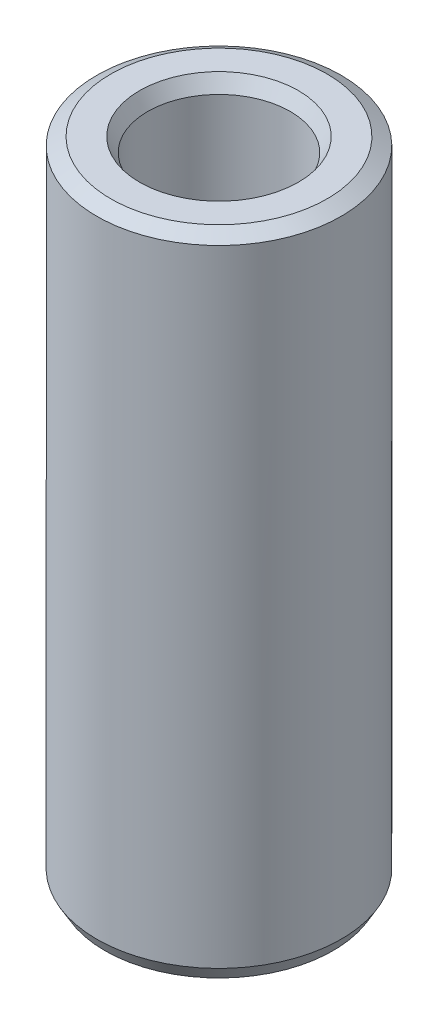
ISO-10303-21;
HEADER;
FILE_DESCRIPTION(('STEP AP214'),'2;1');
FILE_NAME('part.step','',(''),(''),'','','');
FILE_SCHEMA(('AUTOMOTIVE_DESIGN { 1 0 10303 214 1 1 1 1 }'));
ENDSEC;
DATA;
#1=APPLICATION_CONTEXT('core data for automotive mechanical design processes');
#2=APPLICATION_PROTOCOL_DEFINITION('international standard','automotive_design',2000,#1);
#3=PRODUCT_CONTEXT('',#1,'mechanical');
#4=PRODUCT('Part','Part','',(#3));
#5=PRODUCT_RELATED_PRODUCT_CATEGORY('part','',(#4));
#6=PRODUCT_DEFINITION_FORMATION('','',#4);
#7=PRODUCT_DEFINITION_CONTEXT('part definition',#1,'design');
#8=PRODUCT_DEFINITION('design','',#6,#7);
#9=PRODUCT_DEFINITION_SHAPE('','',#8);
#10=(LENGTH_UNIT() NAMED_UNIT(*) SI_UNIT(.MILLI.,.METRE.));
#11=(NAMED_UNIT(*) PLANE_ANGLE_UNIT() SI_UNIT($,.RADIAN.));
#12=(NAMED_UNIT(*) SI_UNIT($,.STERADIAN.) SOLID_ANGLE_UNIT());
#13=UNCERTAINTY_MEASURE_WITH_UNIT(LENGTH_MEASURE(1.E-05),#10,'distance_accuracy_value','');
#14=(GEOMETRIC_REPRESENTATION_CONTEXT(3) GLOBAL_UNCERTAINTY_ASSIGNED_CONTEXT((#13)) GLOBAL_UNIT_ASSIGNED_CONTEXT((#10,
#11,#12)) REPRESENTATION_CONTEXT('',''));
#15=CARTESIAN_POINT('',(0.,0.,0.));
#16=DIRECTION('',(0.,0.,1.));
#17=DIRECTION('',(1.,0.,0.));
#18=AXIS2_PLACEMENT_3D('',#15,#16,#17);
#19=CARTESIAN_POINT('',(0.,225.431002696358,0.));
#20=DIRECTION('',(0.,-1.,0.));
#21=DIRECTION('',(0.,0.,-1.));
#22=AXIS2_PLACEMENT_3D('',#19,#20,#21);
#23=CYLINDRICAL_SURFACE('',#22,42.5);
#24=CARTESIAN_POINT('',(0.,4.87765671901039,0.));
#25=DIRECTION('',(0.,1.,0.));
#26=DIRECTION('',(0.,0.,1.));
#27=AXIS2_PLACEMENT_3D('',#24,#25,#26);
#28=CIRCLE('',#27,42.5);
#29=CARTESIAN_POINT('',(0.,4.87765671901036,-42.5));
#30=VERTEX_POINT('',#29);
#31=EDGE_CURVE('E10',#30,#30,#28,.T.);
#32=CARTESIAN_POINT('',(0.,222.614886276623,0.));
#33=DIRECTION('',(0.,1.,0.));
#34=DIRECTION('',(0.,0.,1.));
#35=AXIS2_PLACEMENT_3D('',#32,#33,#34);
#36=CIRCLE('',#35,42.5);
#37=CARTESIAN_POINT('',(0.,222.614886276623,-42.5));
#38=VERTEX_POINT('',#37);
#39=EDGE_CURVE('E50',#38,#38,#36,.F.);
#40=CARTESIAN_POINT('',(0.,4.87765671901036,-42.5));
#41=CARTESIAN_POINT('',(0.,7.14575286023549,-42.5));
#42=CARTESIAN_POINT('',(0.,9.41384900146062,-42.5));
#43=CARTESIAN_POINT('',(0.,13.9500412839109,-42.5));
#44=CARTESIAN_POINT('',(0.,16.218137425136,-42.5));
#45=CARTESIAN_POINT('',(0.,20.7543297075863,-42.5));
#46=CARTESIAN_POINT('',(0.,23.0224258488114,-42.5));
#47=CARTESIAN_POINT('',(0.,27.5586181312617,-42.5));
#48=CARTESIAN_POINT('',(0.,29.8267142724868,-42.5));
#49=CARTESIAN_POINT('',(0.,34.362906554937,-42.5));
#50=CARTESIAN_POINT('',(0.,36.6310026961622,-42.5));
#51=CARTESIAN_POINT('',(0.,41.1671949786124,-42.5));
#52=CARTESIAN_POINT('',(0.,43.4352911198376,-42.5));
#53=CARTESIAN_POINT('',(0.,47.9714834022878,-42.5));
#54=CARTESIAN_POINT('',(0.,50.2395795435129,-42.5));
#55=CARTESIAN_POINT('',(0.,54.7757718259632,-42.5));
#56=CARTESIAN_POINT('',(0.,57.0438679671883,-42.5));
#57=CARTESIAN_POINT('',(0.,61.5800602496386,-42.5));
#58=CARTESIAN_POINT('',(0.,63.8481563908637,-42.5));
#59=CARTESIAN_POINT('',(0.,68.384348673314,-42.5));
#60=CARTESIAN_POINT('',(0.,70.6524448145391,-42.5));
#61=CARTESIAN_POINT('',(0.,75.1886370969894,-42.5));
#62=CARTESIAN_POINT('',(0.,77.4567332382145,-42.5));
#63=CARTESIAN_POINT('',(0.,81.9929255206648,-42.5));
#64=CARTESIAN_POINT('',(0.,84.2610216618899,-42.5));
#65=CARTESIAN_POINT('',(0.,88.7972139443401,-42.5));
#66=CARTESIAN_POINT('',(0.,91.0653100855653,-42.5));
#67=CARTESIAN_POINT('',(0.,95.6015023680156,-42.5));
#68=CARTESIAN_POINT('',(0.,97.8695985092407,-42.5));
#69=CARTESIAN_POINT('',(0.,102.405790791691,-42.5));
#70=CARTESIAN_POINT('',(0.,104.673886932916,-42.5));
#71=CARTESIAN_POINT('',(0.,109.210079215366,-42.5));
#72=CARTESIAN_POINT('',(0.,111.478175356591,-42.5));
#73=CARTESIAN_POINT('',(0.,116.014367639042,-42.5));
#74=CARTESIAN_POINT('',(0.,118.282463780267,-42.5));
#75=CARTESIAN_POINT('',(0.,122.818656062717,-42.5));
#76=CARTESIAN_POINT('',(0.,125.086752203942,-42.5));
#77=CARTESIAN_POINT('',(0.,129.622944486392,-42.5));
#78=CARTESIAN_POINT('',(0.,131.891040627618,-42.5));
#79=CARTESIAN_POINT('',(0.,136.427232910068,-42.5));
#80=CARTESIAN_POINT('',(0.,138.695329051293,-42.5));
#81=CARTESIAN_POINT('',(0.,143.231521333743,-42.5));
#82=CARTESIAN_POINT('',(0.,145.499617474968,-42.5));
#83=CARTESIAN_POINT('',(0.,150.035809757419,-42.5));
#84=CARTESIAN_POINT('',(0.,152.303905898644,-42.5));
#85=CARTESIAN_POINT('',(0.,156.840098181094,-42.5));
#86=CARTESIAN_POINT('',(0.,159.108194322319,-42.5));
#87=CARTESIAN_POINT('',(0.,163.644386604769,-42.5));
#88=CARTESIAN_POINT('',(0.,165.912482745995,-42.5));
#89=CARTESIAN_POINT('',(0.,170.448675028445,-42.5));
#90=CARTESIAN_POINT('',(0.,172.71677116967,-42.5));
#91=CARTESIAN_POINT('',(0.,177.25296345212,-42.5));
#92=CARTESIAN_POINT('',(0.,179.521059593345,-42.5));
#93=CARTESIAN_POINT('',(0.,184.057251875796,-42.5));
#94=CARTESIAN_POINT('',(0.,186.325348017021,-42.5));
#95=CARTESIAN_POINT('',(0.,190.861540299471,-42.5));
#96=CARTESIAN_POINT('',(0.,193.129636440696,-42.5));
#97=CARTESIAN_POINT('',(0.,197.665828723146,-42.5));
#98=CARTESIAN_POINT('',(0.,199.933924864371,-42.5));
#99=CARTESIAN_POINT('',(0.,204.470117146822,-42.5));
#100=CARTESIAN_POINT('',(0.,206.738213288047,-42.5));
#101=CARTESIAN_POINT('',(0.,211.274405570497,-42.5));
#102=CARTESIAN_POINT('',(0.,213.542501711722,-42.5));
#103=CARTESIAN_POINT('',(0.,218.078693994173,-42.5));
#104=CARTESIAN_POINT('',(0.,220.346790135398,-42.5));
#105=CARTESIAN_POINT('',(0.,222.614886276623,-42.5));
#106=B_SPLINE_CURVE_WITH_KNOTS('',3,(#40,#41,#42,#43,#44,#45,#46,#47,#48,#49,#50,#51,#52,#53,
#54,#55,#56,#57,#58,#59,#60,#61,#62,#63,#64,#65,#66,#67,#68,#69,#70,#71,#72,#73,#74,#75,#76,#77,
#78,#79,#80,#81,#82,#83,#84,#85,#86,#87,#88,#89,#90,#91,#92,#93,#94,#95,#96,#97,#98,#99,#100,
#101,#102,#103,#104,#105),.UNSPECIFIED.,.F.,.F.,(4,2,2,2,2,2,2,2,2,2,2,2,2,2,2,2,2,2,2,2,2,2,2,
2,2,2,2,2,2,2,2,2,4),(0.,6.80428842367539,13.6085768473508,20.4128652710262,27.2171536947016,
34.0214421183769,40.8257305420523,47.6300189657277,54.4343073894031,61.2385958130785,
68.0428842367539,74.8471726604293,81.6514610841047,88.4557495077801,95.2600379314554,
102.064326355131,108.868614778806,115.672903202482,122.477191626157,129.281480049832,
136.085768473508,142.890056897183,149.694345320859,156.498633744534,163.302922168209,
170.107210591885,176.91149901556,183.715787439235,190.520075862911,197.324364286586,
204.128652710262,210.932941133937,217.737229557612),.UNSPECIFIED.);
#107=EDGE_CURVE('BSEAM39',#30,#38,#106,.T.);
#108=ORIENTED_EDGE('',*,*,#31,.T.);
#109=ORIENTED_EDGE('',*,*,#39,.T.);
#110=ORIENTED_EDGE('',*,*,#107,.T.);
#111=ORIENTED_EDGE('',*,*,#107,.F.);
#112=EDGE_LOOP('',(#108,#110,#109,#111));
#113=FACE_BOUND('',#112,.T.);
#114=ADVANCED_FACE('F39',(#113),#23,.T.);
#115=CARTESIAN_POINT('',(0.,225.431002696358,0.));
#116=DIRECTION('',(0.,1.,0.));
#117=DIRECTION('',(0.,0.,1.));
#118=AXIS2_PLACEMENT_3D('',#115,#116,#117);
#119=PLANE('',#118);
#120=CARTESIAN_POINT('',(0.,225.431002696358,0.));
#121=DIRECTION('',(0.,1.,0.));
#122=DIRECTION('',(0.,0.,1.));
#123=AXIS2_PLACEMENT_3D('',#120,#121,#122);
#124=CIRCLE('',#123,27.6163569974663);
#125=CARTESIAN_POINT('',(0.,225.431002696358,27.6163569974663));
#126=VERTEX_POINT('',#125);
#127=EDGE_CURVE('E58',#126,#126,#124,.F.);
#128=ORIENTED_EDGE('',*,*,#127,.T.);
#129=EDGE_LOOP('',(#128));
#130=FACE_BOUND('',#129,.T.);
#131=CARTESIAN_POINT('',(0.,225.431002696358,0.));
#132=DIRECTION('',(0.,1.,0.));
#133=DIRECTION('',(0.,0.,1.));
#134=AXIS2_PLACEMENT_3D('',#131,#132,#133);
#135=CIRCLE('',#134,37.6223432809901);
#136=CARTESIAN_POINT('',(0.,225.431002696358,-37.6223432809901));
#137=VERTEX_POINT('',#136);
#138=EDGE_CURVE('E61',#137,#137,#135,.T.);
#139=ORIENTED_EDGE('',*,*,#138,.T.);
#140=EDGE_LOOP('',(#139));
#141=FACE_BOUND('',#140,.T.);
#142=ADVANCED_FACE('F88',(#130,#141),#119,.T.);
#143=CARTESIAN_POINT('',(0.,0.,0.));
#144=DIRECTION('',(0.,1.,0.));
#145=DIRECTION('',(0.,0.,1.));
#146=AXIS2_PLACEMENT_3D('',#143,#144,#145);
#147=PLANE('',#146);
#148=CARTESIAN_POINT('',(0.,0.,0.));
#149=DIRECTION('',(0.,1.,0.));
#150=DIRECTION('',(0.,0.,1.));
#151=AXIS2_PLACEMENT_3D('',#148,#149,#150);
#152=CIRCLE('',#151,29.6778972967411);
#153=CARTESIAN_POINT('',(0.,0.,29.6778972967411));
#154=VERTEX_POINT('',#153);
#155=EDGE_CURVE('E51',#154,#154,#152,.T.);
#156=ORIENTED_EDGE('',*,*,#155,.T.);
#157=EDGE_LOOP('',(#156));
#158=FACE_BOUND('',#157,.T.);
#159=CARTESIAN_POINT('',(0.,0.,0.));
#160=DIRECTION('',(0.,1.,0.));
#161=DIRECTION('',(0.,0.,1.));
#162=AXIS2_PLACEMENT_3D('',#159,#160,#161);
#163=CIRCLE('',#162,39.6838835802648);
#164=CARTESIAN_POINT('',(0.,0.,39.6838835802648));
#165=VERTEX_POINT('',#164);
#166=EDGE_CURVE('E54',#165,#165,#163,.F.);
#167=ORIENTED_EDGE('',*,*,#166,.T.);
#168=EDGE_LOOP('',(#167));
#169=FACE_BOUND('',#168,.T.);
#170=ADVANCED_FACE('F83',(#158,#169),#147,.F.);
#171=CARTESIAN_POINT('',(0.,225.431002696358,0.));
#172=DIRECTION('',(0.,-1.,0.));
#173=DIRECTION('',(0.,0.,-1.));
#174=AXIS2_PLACEMENT_3D('',#171,#172,#173);
#175=CYLINDRICAL_SURFACE('',#174,24.8002405777311);
#176=CARTESIAN_POINT('',(0.,220.553345977348,0.));
#177=DIRECTION('',(0.,1.,0.));
#178=DIRECTION('',(0.,0.,1.));
#179=AXIS2_PLACEMENT_3D('',#176,#177,#178);
#180=CIRCLE('',#179,24.8002405777311);
#181=CARTESIAN_POINT('',(0.,220.553345977347,-24.8002405777311));
#182=VERTEX_POINT('',#181);
#183=EDGE_CURVE('E67',#182,#182,#180,.T.);
#184=CARTESIAN_POINT('',(0.,2.81611641973503,0.));
#185=DIRECTION('',(0.,1.,0.));
#186=DIRECTION('',(0.,0.,1.));
#187=AXIS2_PLACEMENT_3D('',#184,#185,#186);
#188=CIRCLE('',#187,24.8002405777311);
#189=CARTESIAN_POINT('',(0.,2.816116419735,-24.8002405777311));
#190=VERTEX_POINT('',#189);
#191=EDGE_CURVE('E69',#190,#190,#188,.F.);
#192=CARTESIAN_POINT('',(0.,220.553345977347,-24.8002405777311));
#193=CARTESIAN_POINT('',(0.,218.285249836122,-24.8002405777311));
#194=CARTESIAN_POINT('',(0.,216.017153694897,-24.8002405777311));
#195=CARTESIAN_POINT('',(0.,211.480961412447,-24.8002405777311));
#196=CARTESIAN_POINT('',(0.,209.212865271222,-24.8002405777311));
#197=CARTESIAN_POINT('',(0.,204.676672988772,-24.8002405777311));
#198=CARTESIAN_POINT('',(0.,202.408576847546,-24.8002405777311));
#199=CARTESIAN_POINT('',(0.,197.872384565096,-24.8002405777311));
#200=CARTESIAN_POINT('',(0.,195.604288423871,-24.8002405777311));
#201=CARTESIAN_POINT('',(0.,191.068096141421,-24.8002405777311));
#202=CARTESIAN_POINT('',(0.,188.800000000196,-24.8002405777311));
#203=CARTESIAN_POINT('',(0.,184.263807717745,-24.8002405777311));
#204=CARTESIAN_POINT('',(0.,181.99571157652,-24.8002405777311));
#205=CARTESIAN_POINT('',(0.,177.45951929407,-24.8002405777311));
#206=CARTESIAN_POINT('',(0.,175.191423152845,-24.8002405777311));
#207=CARTESIAN_POINT('',(0.,170.655230870395,-24.8002405777311));
#208=CARTESIAN_POINT('',(0.,168.38713472917,-24.8002405777311));
#209=CARTESIAN_POINT('',(0.,163.850942446719,-24.8002405777311));
#210=CARTESIAN_POINT('',(0.,161.582846305494,-24.8002405777311));
#211=CARTESIAN_POINT('',(0.,157.046654023044,-24.8002405777311));
#212=CARTESIAN_POINT('',(0.,154.778557881819,-24.8002405777311));
#213=CARTESIAN_POINT('',(0.,150.242365599368,-24.8002405777311));
#214=CARTESIAN_POINT('',(0.,147.974269458143,-24.8002405777311));
#215=CARTESIAN_POINT('',(0.,143.438077175693,-24.8002405777311));
#216=CARTESIAN_POINT('',(0.,141.169981034468,-24.8002405777311));
#217=CARTESIAN_POINT('',(0.,136.633788752018,-24.8002405777311));
#218=CARTESIAN_POINT('',(0.,134.365692610793,-24.8002405777311));
#219=CARTESIAN_POINT('',(0.,129.829500328342,-24.8002405777311));
#220=CARTESIAN_POINT('',(0.,127.561404187117,-24.8002405777311));
#221=CARTESIAN_POINT('',(0.,123.025211904667,-24.8002405777311));
#222=CARTESIAN_POINT('',(0.,120.757115763442,-24.8002405777311));
#223=CARTESIAN_POINT('',(0.,116.220923480992,-24.8002405777311));
#224=CARTESIAN_POINT('',(0.,113.952827339766,-24.8002405777311));
#225=CARTESIAN_POINT('',(0.,109.416635057316,-24.8002405777311));
#226=CARTESIAN_POINT('',(0.,107.148538916091,-24.8002405777311));
#227=CARTESIAN_POINT('',(0.,102.612346633641,-24.8002405777311));
#228=CARTESIAN_POINT('',(0.,100.344250492416,-24.8002405777311));
#229=CARTESIAN_POINT('',(0.,95.8080582099653,-24.8002405777311));
#230=CARTESIAN_POINT('',(0.,93.5399620687402,-24.8002405777311));
#231=CARTESIAN_POINT('',(0.,89.00376978629,-24.8002405777311));
#232=CARTESIAN_POINT('',(0.,86.7356736450648,-24.8002405777311));
#233=CARTESIAN_POINT('',(0.,82.1994813626145,-24.8002405777311));
#234=CARTESIAN_POINT('',(0.,79.9313852213894,-24.8002405777311));
#235=CARTESIAN_POINT('',(0.,75.3951929389392,-24.8002405777311));
#236=CARTESIAN_POINT('',(0.,73.127096797714,-24.8002405777311));
#237=CARTESIAN_POINT('',(0.,68.5909045152638,-24.8002405777311));
#238=CARTESIAN_POINT('',(0.,66.3228083740386,-24.8002405777311));
#239=CARTESIAN_POINT('',(0.,61.7866160915884,-24.8002405777311));
#240=CARTESIAN_POINT('',(0.,59.5185199503633,-24.8002405777311));
#241=CARTESIAN_POINT('',(0.,54.982327667913,-24.8002405777311));
#242=CARTESIAN_POINT('',(0.,52.7142315266879,-24.8002405777311));
#243=CARTESIAN_POINT('',(0.,48.1780392442376,-24.8002405777311));
#244=CARTESIAN_POINT('',(0.,45.9099431030125,-24.8002405777311));
#245=CARTESIAN_POINT('',(0.,41.3737508205622,-24.8002405777311));
#246=CARTESIAN_POINT('',(0.,39.1056546793371,-24.8002405777311));
#247=CARTESIAN_POINT('',(0.,34.5694623968868,-24.8002405777311));
#248=CARTESIAN_POINT('',(0.,32.3013662556617,-24.8002405777311));
#249=CARTESIAN_POINT('',(0.,27.7651739732114,-24.8002405777311));
#250=CARTESIAN_POINT('',(0.,25.4970778319863,-24.8002405777311));
#251=CARTESIAN_POINT('',(0.,20.9608855495361,-24.8002405777311));
#252=CARTESIAN_POINT('',(0.,18.6927894083109,-24.8002405777311));
#253=CARTESIAN_POINT('',(0.,14.1565971258607,-24.8002405777311));
#254=CARTESIAN_POINT('',(0.,11.8885009846355,-24.8002405777311));
#255=CARTESIAN_POINT('',(0.,7.35230870218527,-24.8002405777311));
#256=CARTESIAN_POINT('',(0.,5.08421256096014,-24.8002405777311));
#257=CARTESIAN_POINT('',(0.,2.816116419735,-24.8002405777311));
#258=B_SPLINE_CURVE_WITH_KNOTS('',3,(#192,#193,#194,#195,#196,#197,#198,#199,#200,#201,#202,
#203,#204,#205,#206,#207,#208,#209,#210,#211,#212,#213,#214,#215,#216,#217,#218,#219,#220,#221,
#222,#223,#224,#225,#226,#227,#228,#229,#230,#231,#232,#233,#234,#235,#236,#237,#238,#239,#240,
#241,#242,#243,#244,#245,#246,#247,#248,#249,#250,#251,#252,#253,#254,#255,#256,#257),
.UNSPECIFIED.,.F.,.F.,(4,2,2,2,2,2,2,2,2,2,2,2,2,2,2,2,2,2,2,2,2,2,2,2,2,2,2,2,2,2,2,2,4),(0.,
6.80428842367536,13.6085768473508,20.4128652710261,27.2171536947015,34.0214421183769,
40.8257305420523,47.6300189657277,54.4343073894031,61.2385958130785,68.0428842367539,
74.8471726604293,81.6514610841047,88.45574950778,95.2600379314554,102.064326355131,
108.868614778806,115.672903202482,122.477191626157,129.281480049832,136.085768473508,
142.890056897183,149.694345320859,156.498633744534,163.302922168209,170.107210591885,
176.91149901556,183.715787439235,190.520075862911,197.324364286586,204.128652710262,
210.932941133937,217.737229557612),.UNSPECIFIED.);
#259=EDGE_CURVE('BSEAM71',#182,#190,#258,.T.);
#260=ORIENTED_EDGE('',*,*,#183,.T.);
#261=ORIENTED_EDGE('',*,*,#191,.T.);
#262=ORIENTED_EDGE('',*,*,#259,.T.);
#263=ORIENTED_EDGE('',*,*,#259,.F.);
#264=EDGE_LOOP('',(#260,#262,#261,#263));
#265=FACE_BOUND('',#264,.T.);
#266=ADVANCED_FACE('F71',(#265),#175,.F.);
#267=CARTESIAN_POINT('',(0.,220.553345977348,0.));
#268=DIRECTION('',(0.,1.,0.));
#269=DIRECTION('',(0.,0.,1.));
#270=AXIS2_PLACEMENT_3D('',#267,#268,#269);
#271=CONICAL_SURFACE('',#270,24.8002405777311,0.523598775598296);
#272=ORIENTED_EDGE('',*,*,#127,.F.);
#273=EDGE_LOOP('',(#272));
#274=FACE_BOUND('',#273,.T.);
#275=ORIENTED_EDGE('',*,*,#183,.F.);
#276=EDGE_LOOP('',(#275));
#277=FACE_BOUND('',#276,.T.);
#278=ADVANCED_FACE('F77',(#274,#277),#271,.F.);
#279=CARTESIAN_POINT('',(0.,0.,0.));
#280=DIRECTION('',(0.,-1.,0.));
#281=DIRECTION('',(0.,0.,-1.));
#282=AXIS2_PLACEMENT_3D('',#279,#280,#281);
#283=CONICAL_SURFACE('',#282,29.6778972967411,1.04719755119659);
#284=ORIENTED_EDGE('',*,*,#191,.F.);
#285=EDGE_LOOP('',(#284));
#286=FACE_BOUND('',#285,.T.);
#287=ORIENTED_EDGE('',*,*,#155,.F.);
#288=EDGE_LOOP('',(#287));
#289=FACE_BOUND('',#288,.T.);
#290=ADVANCED_FACE('F73',(#286,#289),#283,.F.);
#291=CARTESIAN_POINT('',(0.,4.87765671901039,0.));
#292=DIRECTION('',(0.,1.,0.));
#293=DIRECTION('',(0.,0.,1.));
#294=AXIS2_PLACEMENT_3D('',#291,#292,#293);
#295=CONICAL_SURFACE('',#294,42.5,0.523598775598301);
#296=ORIENTED_EDGE('',*,*,#166,.F.);
#297=EDGE_LOOP('',(#296));
#298=FACE_BOUND('',#297,.T.);
#299=ORIENTED_EDGE('',*,*,#31,.F.);
#300=EDGE_LOOP('',(#299));
#301=FACE_BOUND('',#300,.T.);
#302=ADVANCED_FACE('F76',(#298,#301),#295,.T.);
#303=CARTESIAN_POINT('',(0.,225.431002696358,0.));
#304=DIRECTION('',(0.,-1.,0.));
#305=DIRECTION('',(0.,0.,-1.));
#306=AXIS2_PLACEMENT_3D('',#303,#304,#305);
#307=CONICAL_SURFACE('',#306,37.6223432809901,1.04719755119659);
#308=CARTESIAN_POINT('',(0.,222.614886276623,-42.5));
#309=CARTESIAN_POINT('',(0.,222.644220822662,-42.4491910758437));
#310=CARTESIAN_POINT('',(0.,222.673555368701,-42.3983821516873));
#311=CARTESIAN_POINT('',(0.,222.732224460778,-42.2967643033746));
#312=CARTESIAN_POINT('',(0.,222.761559006817,-42.2459553792183));
#313=CARTESIAN_POINT('',(0.,222.820228098895,-42.1443375309056));
#314=CARTESIAN_POINT('',(0.,222.849562644934,-42.0935286067492));
#315=CARTESIAN_POINT('',(0.,222.908231737012,-41.9919107584365));
#316=CARTESIAN_POINT('',(0.,222.937566283051,-41.9411018342802));
#317=CARTESIAN_POINT('',(0.,222.996235375129,-41.8394839859674));
#318=CARTESIAN_POINT('',(0.,223.025569921167,-41.7886750618111));
#319=CARTESIAN_POINT('',(0.,223.084239013245,-41.6870572134984));
#320=CARTESIAN_POINT('',(0.,223.113573559284,-41.636248289342));
#321=CARTESIAN_POINT('',(0.,223.172242651362,-41.5346304410293));
#322=CARTESIAN_POINT('',(0.,223.201577197401,-41.483821516873));
#323=CARTESIAN_POINT('',(0.,223.260246289479,-41.3822036685603));
#324=CARTESIAN_POINT('',(0.,223.289580835518,-41.3313947444039));
#325=CARTESIAN_POINT('',(0.,223.348249927595,-41.2297768960912));
#326=CARTESIAN_POINT('',(0.,223.377584473634,-41.1789679719349));
#327=CARTESIAN_POINT('',(0.,223.436253565712,-41.0773501236222));
#328=CARTESIAN_POINT('',(0.,223.465588111751,-41.0265411994658));
#329=CARTESIAN_POINT('',(0.,223.524257203829,-40.9249233511531));
#330=CARTESIAN_POINT('',(0.,223.553591749868,-40.8741144269967));
#331=CARTESIAN_POINT('',(0.,223.612260841946,-40.772496578684));
#332=CARTESIAN_POINT('',(0.,223.641595387984,-40.7216876545277));
#333=CARTESIAN_POINT('',(0.,223.700264480062,-40.620069806215));
#334=CARTESIAN_POINT('',(0.,223.729599026101,-40.5692608820586));
#335=CARTESIAN_POINT('',(0.,223.788268118179,-40.4676430337459));
#336=CARTESIAN_POINT('',(0.,223.817602664218,-40.4168341095896));
#337=CARTESIAN_POINT('',(0.,223.876271756296,-40.3152162612769));
#338=CARTESIAN_POINT('',(0.,223.905606302335,-40.2644073371205));
#339=CARTESIAN_POINT('',(0.,223.964275394412,-40.1627894888078));
#340=CARTESIAN_POINT('',(0.,223.993609940451,-40.1119805646514));
#341=CARTESIAN_POINT('',(0.,224.052279032529,-40.0103627163387));
#342=CARTESIAN_POINT('',(0.,224.081613578568,-39.9595537921824));
#343=CARTESIAN_POINT('',(0.,224.140282670646,-39.8579359438697));
#344=CARTESIAN_POINT('',(0.,224.169617216685,-39.8071270197133));
#345=CARTESIAN_POINT('',(0.,224.228286308763,-39.7055091714006));
#346=CARTESIAN_POINT('',(0.,224.257620854802,-39.6547002472443));
#347=CARTESIAN_POINT('',(0.,224.316289946879,-39.5530823989316));
#348=CARTESIAN_POINT('',(0.,224.345624492918,-39.5022734747752));
#349=CARTESIAN_POINT('',(0.,224.404293584996,-39.4006556264625));
#350=CARTESIAN_POINT('',(0.,224.433628131035,-39.3498467023061));
#351=CARTESIAN_POINT('',(0.,224.492297223113,-39.2482288539934));
#352=CARTESIAN_POINT('',(0.,224.521631769152,-39.1974199298371));
#353=CARTESIAN_POINT('',(0.,224.580300861229,-39.0958020815244));
#354=CARTESIAN_POINT('',(0.,224.609635407268,-39.044993157368));
#355=CARTESIAN_POINT('',(0.,224.668304499346,-38.9433753090553));
#356=CARTESIAN_POINT('',(0.,224.697639045385,-38.892566384899));
#357=CARTESIAN_POINT('',(0.,224.756308137463,-38.7909485365863));
#358=CARTESIAN_POINT('',(0.,224.785642683502,-38.7401396124299));
#359=CARTESIAN_POINT('',(0.,224.84431177558,-38.6385217641172));
#360=CARTESIAN_POINT('',(0.,224.873646321619,-38.5877128399608));
#361=CARTESIAN_POINT('',(0.,224.932315413696,-38.4860949916481));
#362=CARTESIAN_POINT('',(0.,224.961649959735,-38.4352860674918));
#363=CARTESIAN_POINT('',(0.,225.020319051813,-38.3336682191791));
#364=CARTESIAN_POINT('',(0.,225.049653597852,-38.2828592950227));
#365=CARTESIAN_POINT('',(0.,225.10832268993,-38.18124144671));
#366=CARTESIAN_POINT('',(0.,225.137657235969,-38.1304325225537));
#367=CARTESIAN_POINT('',(0.,225.196326328046,-38.028814674241));
#368=CARTESIAN_POINT('',(0.,225.225660874085,-37.9780057500846));
#369=CARTESIAN_POINT('',(0.,225.284329966163,-37.8763879017719));
#370=CARTESIAN_POINT('',(0.,225.313664512202,-37.8255789776155));
#371=CARTESIAN_POINT('',(0.,225.37233360428,-37.7239611293028));
#372=CARTESIAN_POINT('',(0.,225.401668150319,-37.6731522051465));
#373=CARTESIAN_POINT('',(0.,225.431002696358,-37.6223432809901));
#374=B_SPLINE_CURVE_WITH_KNOTS('',3,(#308,#309,#310,#311,#312,#313,#314,#315,#316,#317,#318,
#319,#320,#321,#322,#323,#324,#325,#326,#327,#328,#329,#330,#331,#332,#333,#334,#335,#336,#337,
#338,#339,#340,#341,#342,#343,#344,#345,#346,#347,#348,#349,#350,#351,#352,#353,#354,#355,#356,
#357,#358,#359,#360,#361,#362,#363,#364,#365,#366,#367,#368,#369,#370,#371,#372,#373),
.UNSPECIFIED.,.F.,.F.,(4,2,2,2,2,2,2,2,2,2,2,2,2,2,2,2,2,2,2,2,2,2,2,2,2,2,2,2,2,2,2,2,4),(0.,
0.176007276233439,0.352014552466885,0.52802182870031,0.70402910493375,0.880036381167176,
1.05604365740062,1.23205093363405,1.40805820986749,1.58406548610093,1.76007276233435,
1.93608003856779,2.11208731480123,2.28809459103466,2.4641018672681,2.64010914350153,
2.81611641973497,2.99212369596841,3.16813097220183,3.34413824843527,3.5201455246687,
3.69615280090214,3.87216007713558,4.04816735336901,4.22417462960245,4.40018190583587,
4.57618918206932,4.75219645830276,4.92820373453618,5.10421101076962,5.28021828700305,
5.45622556323649,5.63223283946993),.UNSPECIFIED.);
#375=EDGE_CURVE('BSEAM45',#38,#137,#374,.T.);
#376=ORIENTED_EDGE('',*,*,#39,.F.);
#377=ORIENTED_EDGE('',*,*,#138,.F.);
#378=ORIENTED_EDGE('',*,*,#375,.T.);
#379=ORIENTED_EDGE('',*,*,#375,.F.);
#380=EDGE_LOOP('',(#376,#378,#377,#379));
#381=FACE_BOUND('',#380,.T.);
#382=ADVANCED_FACE('F45',(#381),#307,.T.);
#383=CLOSED_SHELL('',(#114,#142,#170,#266,#278,#290,#302,#382));
#384=MANIFOLD_SOLID_BREP('B2',#383);
#385=ADVANCED_BREP_SHAPE_REPRESENTATION('',(#18,#384),#14);
#386=SHAPE_DEFINITION_REPRESENTATION(#9,#385);
ENDSEC;
END-ISO-10303-21;
